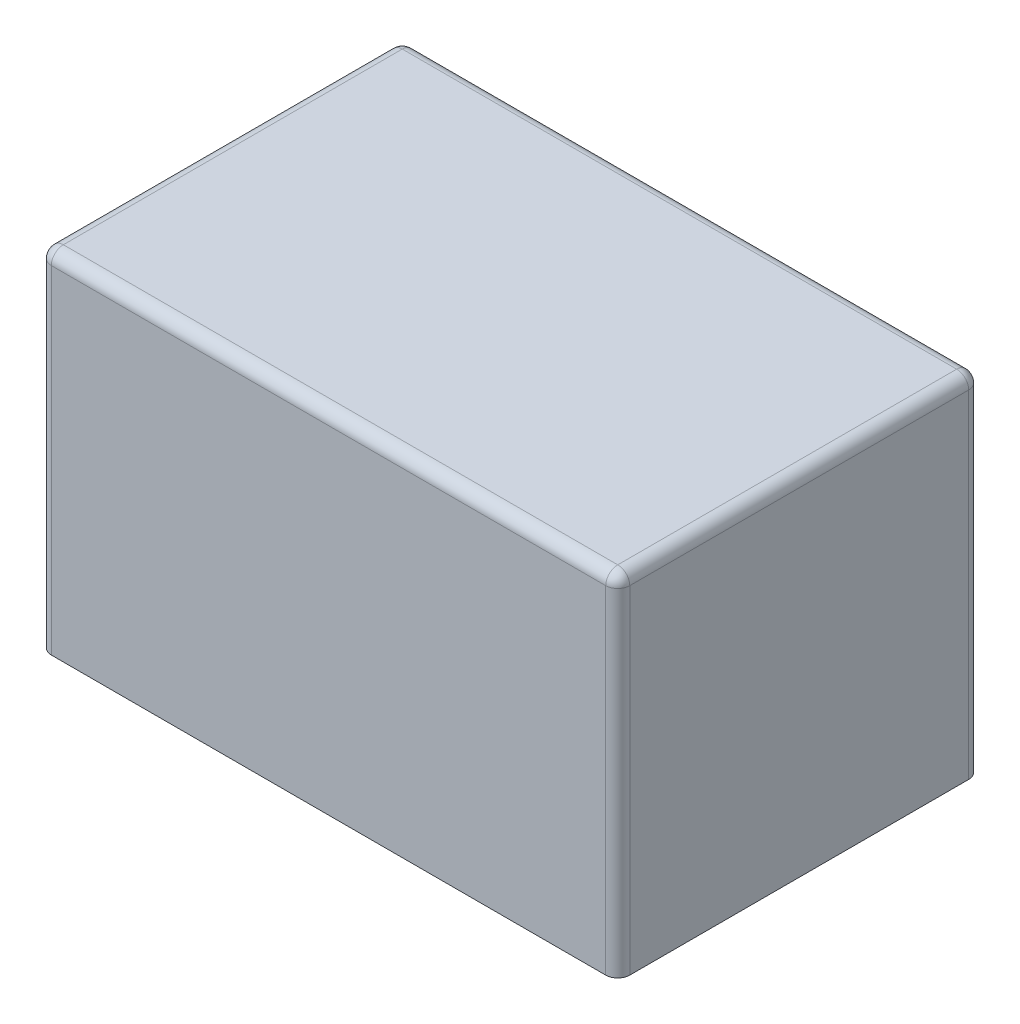
ISO-10303-21;
HEADER;
FILE_DESCRIPTION(('STEP AP214'),'2;1');
FILE_NAME('part.step','',(''),(''),'','','');
FILE_SCHEMA(('AUTOMOTIVE_DESIGN { 1 0 10303 214 1 1 1 1 }'));
ENDSEC;
DATA;
#1=APPLICATION_CONTEXT('core data for automotive mechanical design processes');
#2=APPLICATION_PROTOCOL_DEFINITION('international standard','automotive_design',2000,#1);
#3=PRODUCT_CONTEXT('',#1,'mechanical');
#4=PRODUCT('Part','Part','',(#3));
#5=PRODUCT_RELATED_PRODUCT_CATEGORY('part','',(#4));
#6=PRODUCT_DEFINITION_FORMATION('','',#4);
#7=PRODUCT_DEFINITION_CONTEXT('part definition',#1,'design');
#8=PRODUCT_DEFINITION('design','',#6,#7);
#9=PRODUCT_DEFINITION_SHAPE('','',#8);
#10=(LENGTH_UNIT() NAMED_UNIT(*) SI_UNIT(.MILLI.,.METRE.));
#11=(NAMED_UNIT(*) PLANE_ANGLE_UNIT() SI_UNIT($,.RADIAN.));
#12=(NAMED_UNIT(*) SI_UNIT($,.STERADIAN.) SOLID_ANGLE_UNIT());
#13=UNCERTAINTY_MEASURE_WITH_UNIT(LENGTH_MEASURE(1.E-05),#10,'distance_accuracy_value','');
#14=(GEOMETRIC_REPRESENTATION_CONTEXT(3) GLOBAL_UNCERTAINTY_ASSIGNED_CONTEXT((#13)) GLOBAL_UNIT_ASSIGNED_CONTEXT((#10,
#11,#12)) REPRESENTATION_CONTEXT('',''));
#15=CARTESIAN_POINT('',(0.,0.,0.));
#16=DIRECTION('',(0.,0.,1.));
#17=DIRECTION('',(1.,0.,0.));
#18=AXIS2_PLACEMENT_3D('',#15,#16,#17);
#19=CARTESIAN_POINT('',(-7.65,9.24,-4.8));
#20=DIRECTION('',(1.,0.,0.));
#21=DIRECTION('',(0.,0.,-1.));
#22=AXIS2_PLACEMENT_3D('',#19,#20,#21);
#23=PLANE('',#22);
#24=DIRECTION('',(0.,0.,1.));
#25=VECTOR('',#24,1.);
#26=CARTESIAN_POINT('',(-7.65,8.922,-4.8));
#27=LINE('',#26,#25);
#28=CARTESIAN_POINT('',(-7.65,8.922,4.482));
#29=VERTEX_POINT('',#28);
#30=CARTESIAN_POINT('',(-7.65,8.922,-4.482));
#31=VERTEX_POINT('',#30);
#32=EDGE_CURVE('E138',#29,#31,#27,.F.);
#33=ORIENTED_EDGE('',*,*,#32,.T.);
#34=DIRECTION('',(0.,-1.,0.));
#35=VECTOR('',#34,1.);
#36=CARTESIAN_POINT('',(-7.65,9.24,-4.482));
#37=LINE('',#36,#35);
#38=CARTESIAN_POINT('',(-7.65,0.,-4.482));
#39=VERTEX_POINT('',#38);
#40=EDGE_CURVE('E123',#31,#39,#37,.T.);
#41=ORIENTED_EDGE('',*,*,#40,.T.);
#42=DIRECTION('',(0.,0.,1.));
#43=VECTOR('',#42,1.);
#44=CARTESIAN_POINT('',(-7.65,0.,-4.8));
#45=LINE('',#44,#43);
#46=CARTESIAN_POINT('',(-7.65,0.,4.482));
#47=VERTEX_POINT('',#46);
#48=EDGE_CURVE('E135',#39,#47,#45,.T.);
#49=ORIENTED_EDGE('',*,*,#48,.T.);
#50=DIRECTION('',(0.,-1.,0.));
#51=VECTOR('',#50,1.);
#52=CARTESIAN_POINT('',(-7.65,9.24,4.482));
#53=LINE('',#52,#51);
#54=EDGE_CURVE('E163',#47,#29,#53,.F.);
#55=ORIENTED_EDGE('',*,*,#54,.T.);
#56=EDGE_LOOP('',(#33,#41,#49,#55));
#57=FACE_BOUND('',#56,.T.);
#58=ADVANCED_FACE('F39',(#57),#23,.F.);
#59=CARTESIAN_POINT('',(7.65,9.24,4.8));
#60=DIRECTION('',(0.,0.,-1.));
#61=DIRECTION('',(-1.,0.,0.));
#62=AXIS2_PLACEMENT_3D('',#59,#60,#61);
#63=PLANE('',#62);
#64=DIRECTION('',(1.,0.,0.));
#65=VECTOR('',#64,1.);
#66=CARTESIAN_POINT('',(7.65,0.,4.8));
#67=LINE('',#66,#65);
#68=CARTESIAN_POINT('',(-7.332,0.,4.8));
#69=VERTEX_POINT('',#68);
#70=CARTESIAN_POINT('',(7.332,0.,4.8));
#71=VERTEX_POINT('',#70);
#72=EDGE_CURVE('E147',#69,#71,#67,.T.);
#73=ORIENTED_EDGE('',*,*,#72,.T.);
#74=DIRECTION('',(0.,-1.,0.));
#75=VECTOR('',#74,1.);
#76=CARTESIAN_POINT('',(7.332,9.24,4.8));
#77=LINE('',#76,#75);
#78=CARTESIAN_POINT('',(7.332,8.922,4.8));
#79=VERTEX_POINT('',#78);
#80=EDGE_CURVE('E197',#71,#79,#77,.F.);
#81=ORIENTED_EDGE('',*,*,#80,.T.);
#82=DIRECTION('',(1.,0.,0.));
#83=VECTOR('',#82,1.);
#84=CARTESIAN_POINT('',(7.65,8.922,4.8));
#85=LINE('',#84,#83);
#86=CARTESIAN_POINT('',(-7.332,8.922,4.8));
#87=VERTEX_POINT('',#86);
#88=EDGE_CURVE('E194',#79,#87,#85,.F.);
#89=ORIENTED_EDGE('',*,*,#88,.T.);
#90=DIRECTION('',(0.,-1.,0.));
#91=VECTOR('',#90,1.);
#92=CARTESIAN_POINT('',(-7.332,9.24,4.8));
#93=LINE('',#92,#91);
#94=EDGE_CURVE('E191',#87,#69,#93,.T.);
#95=ORIENTED_EDGE('',*,*,#94,.T.);
#96=EDGE_LOOP('',(#73,#81,#89,#95));
#97=FACE_BOUND('',#96,.T.);
#98=ADVANCED_FACE('F290',(#97),#63,.F.);
#99=CARTESIAN_POINT('',(7.65,9.24,-4.8));
#100=DIRECTION('',(-1.,0.,0.));
#101=DIRECTION('',(0.,0.,1.));
#102=AXIS2_PLACEMENT_3D('',#99,#100,#101);
#103=PLANE('',#102);
#104=DIRECTION('',(0.,0.,-1.));
#105=VECTOR('',#104,1.);
#106=CARTESIAN_POINT('',(7.65,0.,-4.8));
#107=LINE('',#106,#105);
#108=CARTESIAN_POINT('',(7.65,0.,4.482));
#109=VERTEX_POINT('',#108);
#110=CARTESIAN_POINT('',(7.65,0.,-4.482));
#111=VERTEX_POINT('',#110);
#112=EDGE_CURVE('E152',#109,#111,#107,.T.);
#113=ORIENTED_EDGE('',*,*,#112,.T.);
#114=DIRECTION('',(0.,-1.,0.));
#115=VECTOR('',#114,1.);
#116=CARTESIAN_POINT('',(7.65,9.24,-4.482));
#117=LINE('',#116,#115);
#118=CARTESIAN_POINT('',(7.65,8.922,-4.482));
#119=VERTEX_POINT('',#118);
#120=EDGE_CURVE('E188',#111,#119,#117,.F.);
#121=ORIENTED_EDGE('',*,*,#120,.T.);
#122=DIRECTION('',(0.,0.,-1.));
#123=VECTOR('',#122,1.);
#124=CARTESIAN_POINT('',(7.65,8.922,-4.8));
#125=LINE('',#124,#123);
#126=CARTESIAN_POINT('',(7.65,8.922,4.482));
#127=VERTEX_POINT('',#126);
#128=EDGE_CURVE('E182',#119,#127,#125,.F.);
#129=ORIENTED_EDGE('',*,*,#128,.T.);
#130=DIRECTION('',(0.,-1.,0.));
#131=VECTOR('',#130,1.);
#132=CARTESIAN_POINT('',(7.65,9.24,4.482));
#133=LINE('',#132,#131);
#134=EDGE_CURVE('E185',#127,#109,#133,.T.);
#135=ORIENTED_EDGE('',*,*,#134,.T.);
#136=EDGE_LOOP('',(#113,#121,#129,#135));
#137=FACE_BOUND('',#136,.T.);
#138=ADVANCED_FACE('F263',(#137),#103,.F.);
#139=CARTESIAN_POINT('',(7.65,9.24,-4.8));
#140=DIRECTION('',(0.,0.,1.));
#141=DIRECTION('',(1.,0.,0.));
#142=AXIS2_PLACEMENT_3D('',#139,#140,#141);
#143=PLANE('',#142);
#144=DIRECTION('',(-1.,0.,0.));
#145=VECTOR('',#144,1.);
#146=CARTESIAN_POINT('',(7.65,0.,-4.8));
#147=LINE('',#146,#145);
#148=CARTESIAN_POINT('',(7.332,0.,-4.8));
#149=VERTEX_POINT('',#148);
#150=CARTESIAN_POINT('',(-7.332,0.,-4.8));
#151=VERTEX_POINT('',#150);
#152=EDGE_CURVE('E160',#149,#151,#147,.T.);
#153=ORIENTED_EDGE('',*,*,#152,.T.);
#154=DIRECTION('',(0.,-1.,0.));
#155=VECTOR('',#154,1.);
#156=CARTESIAN_POINT('',(-7.332,9.24,-4.8));
#157=LINE('',#156,#155);
#158=CARTESIAN_POINT('',(-7.332,8.922,-4.8));
#159=VERTEX_POINT('',#158);
#160=EDGE_CURVE('E124',#151,#159,#157,.F.);
#161=ORIENTED_EDGE('',*,*,#160,.T.);
#162=DIRECTION('',(-1.,0.,0.));
#163=VECTOR('',#162,1.);
#164=CARTESIAN_POINT('',(7.65,8.922,-4.8));
#165=LINE('',#164,#163);
#166=CARTESIAN_POINT('',(7.332,8.922,-4.8));
#167=VERTEX_POINT('',#166);
#168=EDGE_CURVE('E130',#159,#167,#165,.F.);
#169=ORIENTED_EDGE('',*,*,#168,.T.);
#170=DIRECTION('',(0.,-1.,0.));
#171=VECTOR('',#170,1.);
#172=CARTESIAN_POINT('',(7.332,9.24,-4.8));
#173=LINE('',#172,#171);
#174=EDGE_CURVE('E177',#167,#149,#173,.T.);
#175=ORIENTED_EDGE('',*,*,#174,.T.);
#176=EDGE_LOOP('',(#153,#161,#169,#175));
#177=FACE_BOUND('',#176,.T.);
#178=ADVANCED_FACE('F300',(#177),#143,.F.);
#179=CARTESIAN_POINT('',(0.,9.24,0.));
#180=DIRECTION('',(0.,-1.,0.));
#181=DIRECTION('',(0.,0.,-1.));
#182=AXIS2_PLACEMENT_3D('',#179,#180,#181);
#183=PLANE('',#182);
#184=DIRECTION('',(1.,0.,0.));
#185=VECTOR('',#184,1.);
#186=CARTESIAN_POINT('',(0.,9.24,4.482));
#187=LINE('',#186,#185);
#188=CARTESIAN_POINT('',(-7.332,9.24,4.482));
#189=VERTEX_POINT('',#188);
#190=CARTESIAN_POINT('',(7.332,9.24,4.482));
#191=VERTEX_POINT('',#190);
#192=EDGE_CURVE('E63',#189,#191,#187,.T.);
#193=ORIENTED_EDGE('',*,*,#192,.T.);
#194=DIRECTION('',(0.,0.,-1.));
#195=VECTOR('',#194,1.);
#196=CARTESIAN_POINT('',(7.332,9.24,0.));
#197=LINE('',#196,#195);
#198=CARTESIAN_POINT('',(7.332,9.24,-4.482));
#199=VERTEX_POINT('',#198);
#200=EDGE_CURVE('E11',#191,#199,#197,.T.);
#201=ORIENTED_EDGE('',*,*,#200,.T.);
#202=DIRECTION('',(-1.,0.,0.));
#203=VECTOR('',#202,1.);
#204=CARTESIAN_POINT('',(0.,9.24,-4.482));
#205=LINE('',#204,#203);
#206=CARTESIAN_POINT('',(-7.332,9.24,-4.482));
#207=VERTEX_POINT('',#206);
#208=EDGE_CURVE('E49',#199,#207,#205,.T.);
#209=ORIENTED_EDGE('',*,*,#208,.T.);
#210=DIRECTION('',(0.,0.,1.));
#211=VECTOR('',#210,1.);
#212=CARTESIAN_POINT('',(-7.332,9.24,0.));
#213=LINE('',#212,#211);
#214=EDGE_CURVE('E200',#207,#189,#213,.T.);
#215=ORIENTED_EDGE('',*,*,#214,.T.);
#216=EDGE_LOOP('',(#193,#201,#209,#215));
#217=FACE_BOUND('',#216,.T.);
#218=ADVANCED_FACE('F271',(#217),#183,.F.);
#219=CARTESIAN_POINT('',(0.,0.,0.));
#220=DIRECTION('',(0.,-1.,0.));
#221=DIRECTION('',(0.,0.,-1.));
#222=AXIS2_PLACEMENT_3D('',#219,#220,#221);
#223=PLANE('',#222);
#224=ORIENTED_EDGE('',*,*,#48,.F.);
#225=CARTESIAN_POINT('',(-7.332,0.,-4.482));
#226=DIRECTION('',(0.,-1.,0.));
#227=DIRECTION('',(0.,0.,-1.));
#228=AXIS2_PLACEMENT_3D('',#225,#226,#227);
#229=CIRCLE('',#228,0.318);
#230=EDGE_CURVE('E119',#39,#151,#229,.T.);
#231=ORIENTED_EDGE('',*,*,#230,.T.);
#232=ORIENTED_EDGE('',*,*,#152,.F.);
#233=CARTESIAN_POINT('',(7.332,0.,-4.482));
#234=DIRECTION('',(0.,-1.,0.));
#235=DIRECTION('',(0.,0.,-1.));
#236=AXIS2_PLACEMENT_3D('',#233,#234,#235);
#237=CIRCLE('',#236,0.318);
#238=EDGE_CURVE('E131',#149,#111,#237,.T.);
#239=ORIENTED_EDGE('',*,*,#238,.T.);
#240=ORIENTED_EDGE('',*,*,#112,.F.);
#241=CARTESIAN_POINT('',(7.332,0.,4.482));
#242=DIRECTION('',(0.,-1.,0.));
#243=DIRECTION('',(0.,0.,-1.));
#244=AXIS2_PLACEMENT_3D('',#241,#242,#243);
#245=CIRCLE('',#244,0.318);
#246=EDGE_CURVE('E170',#109,#71,#245,.T.);
#247=ORIENTED_EDGE('',*,*,#246,.T.);
#248=ORIENTED_EDGE('',*,*,#72,.F.);
#249=CARTESIAN_POINT('',(-7.332,0.,4.482));
#250=DIRECTION('',(0.,-1.,0.));
#251=DIRECTION('',(0.,0.,-1.));
#252=AXIS2_PLACEMENT_3D('',#249,#250,#251);
#253=CIRCLE('',#252,0.318);
#254=EDGE_CURVE('E141',#69,#47,#253,.T.);
#255=ORIENTED_EDGE('',*,*,#254,.T.);
#256=EDGE_LOOP('',(#224,#231,#232,#239,#240,#247,#248,#255));
#257=FACE_BOUND('',#256,.T.);
#258=ADVANCED_FACE('F143',(#257),#223,.T.);
#259=CARTESIAN_POINT('',(7.332,9.24,4.482));
#260=DIRECTION('',(0.,-1.,0.));
#261=DIRECTION('',(0.,0.,-1.));
#262=AXIS2_PLACEMENT_3D('',#259,#260,#261);
#263=CYLINDRICAL_SURFACE('',#262,0.318);
#264=CARTESIAN_POINT('',(7.332,8.922,4.482));
#265=DIRECTION('',(0.,1.,0.));
#266=DIRECTION('',(0.,0.,1.));
#267=AXIS2_PLACEMENT_3D('',#264,#265,#266);
#268=CIRCLE('',#267,0.318);
#269=EDGE_CURVE('E43',#79,#127,#268,.T.);
#270=ORIENTED_EDGE('',*,*,#269,.F.);
#271=ORIENTED_EDGE('',*,*,#80,.F.);
#272=ORIENTED_EDGE('',*,*,#246,.F.);
#273=ORIENTED_EDGE('',*,*,#134,.F.);
#274=EDGE_LOOP('',(#270,#271,#272,#273));
#275=FACE_BOUND('',#274,.T.);
#276=ADVANCED_FACE('F41',(#275),#263,.T.);
#277=CARTESIAN_POINT('',(7.332,8.922,4.482));
#278=DIRECTION('',(0.,0.,1.));
#279=DIRECTION('',(1.,0.,0.));
#280=AXIS2_PLACEMENT_3D('',#277,#278,#279);
#281=SPHERICAL_SURFACE('',#280,0.318);
#282=CARTESIAN_POINT('',(7.332,8.922,4.482));
#283=DIRECTION('',(1.,0.,0.));
#284=DIRECTION('',(0.,0.,-1.));
#285=AXIS2_PLACEMENT_3D('',#282,#283,#284);
#286=CIRCLE('',#285,0.318);
#287=EDGE_CURVE('E241',#79,#191,#286,.F.);
#288=ORIENTED_EDGE('',*,*,#287,.F.);
#289=ORIENTED_EDGE('',*,*,#269,.T.);
#290=CARTESIAN_POINT('',(7.332,8.922,4.482));
#291=DIRECTION('',(0.,0.,1.));
#292=DIRECTION('',(0.,-1.,0.));
#293=AXIS2_PLACEMENT_3D('',#290,#291,#292);
#294=CIRCLE('',#293,0.318);
#295=EDGE_CURVE('E155',#191,#127,#294,.F.);
#296=ORIENTED_EDGE('',*,*,#295,.F.);
#297=EDGE_LOOP('',(#288,#289,#296));
#298=FACE_BOUND('',#297,.T.);
#299=ADVANCED_FACE('F254',(#298),#281,.T.);
#300=CARTESIAN_POINT('',(7.332,9.24,-4.482));
#301=DIRECTION('',(0.,-1.,0.));
#302=DIRECTION('',(0.,0.,-1.));
#303=AXIS2_PLACEMENT_3D('',#300,#301,#302);
#304=CYLINDRICAL_SURFACE('',#303,0.318);
#305=ORIENTED_EDGE('',*,*,#238,.F.);
#306=ORIENTED_EDGE('',*,*,#174,.F.);
#307=CARTESIAN_POINT('',(7.332,8.922,-4.482));
#308=DIRECTION('',(0.,1.,0.));
#309=DIRECTION('',(0.,0.,1.));
#310=AXIS2_PLACEMENT_3D('',#307,#308,#309);
#311=CIRCLE('',#310,0.318);
#312=EDGE_CURVE('E237',#119,#167,#311,.T.);
#313=ORIENTED_EDGE('',*,*,#312,.F.);
#314=ORIENTED_EDGE('',*,*,#120,.F.);
#315=EDGE_LOOP('',(#305,#306,#313,#314));
#316=FACE_BOUND('',#315,.T.);
#317=ADVANCED_FACE('F268',(#316),#304,.T.);
#318=CARTESIAN_POINT('',(7.332,8.922,0.));
#319=DIRECTION('',(0.,0.,-1.));
#320=DIRECTION('',(-1.,0.,0.));
#321=AXIS2_PLACEMENT_3D('',#318,#319,#320);
#322=CYLINDRICAL_SURFACE('',#321,0.318);
#323=ORIENTED_EDGE('',*,*,#295,.T.);
#324=ORIENTED_EDGE('',*,*,#128,.F.);
#325=CARTESIAN_POINT('',(7.332,8.922,-4.482));
#326=DIRECTION('',(0.,0.,-1.));
#327=DIRECTION('',(-1.,0.,0.));
#328=AXIS2_PLACEMENT_3D('',#325,#326,#327);
#329=CIRCLE('',#328,0.318);
#330=EDGE_CURVE('E233',#199,#119,#329,.T.);
#331=ORIENTED_EDGE('',*,*,#330,.F.);
#332=ORIENTED_EDGE('',*,*,#200,.F.);
#333=EDGE_LOOP('',(#323,#324,#331,#332));
#334=FACE_BOUND('',#333,.T.);
#335=ADVANCED_FACE('F249',(#334),#322,.T.);
#336=CARTESIAN_POINT('',(0.,8.922,4.482));
#337=DIRECTION('',(1.,0.,0.));
#338=DIRECTION('',(0.,0.,-1.));
#339=AXIS2_PLACEMENT_3D('',#336,#337,#338);
#340=CYLINDRICAL_SURFACE('',#339,0.318);
#341=ORIENTED_EDGE('',*,*,#287,.T.);
#342=ORIENTED_EDGE('',*,*,#192,.F.);
#343=CARTESIAN_POINT('',(-7.332,8.922,4.482));
#344=DIRECTION('',(-1.,0.,0.));
#345=DIRECTION('',(0.,0.,1.));
#346=AXIS2_PLACEMENT_3D('',#343,#344,#345);
#347=CIRCLE('',#346,0.318);
#348=EDGE_CURVE('E229',#87,#189,#347,.T.);
#349=ORIENTED_EDGE('',*,*,#348,.F.);
#350=ORIENTED_EDGE('',*,*,#88,.F.);
#351=EDGE_LOOP('',(#341,#342,#349,#350));
#352=FACE_BOUND('',#351,.T.);
#353=ADVANCED_FACE('F337',(#352),#340,.T.);
#354=CARTESIAN_POINT('',(-7.332,9.24,4.482));
#355=DIRECTION('',(0.,-1.,0.));
#356=DIRECTION('',(0.,0.,-1.));
#357=AXIS2_PLACEMENT_3D('',#354,#355,#356);
#358=CYLINDRICAL_SURFACE('',#357,0.318);
#359=ORIENTED_EDGE('',*,*,#254,.F.);
#360=ORIENTED_EDGE('',*,*,#94,.F.);
#361=CARTESIAN_POINT('',(-7.332,8.922,4.482));
#362=DIRECTION('',(0.,1.,0.));
#363=DIRECTION('',(0.,0.,1.));
#364=AXIS2_PLACEMENT_3D('',#361,#362,#363);
#365=CIRCLE('',#364,0.318);
#366=EDGE_CURVE('E225',#29,#87,#365,.T.);
#367=ORIENTED_EDGE('',*,*,#366,.F.);
#368=ORIENTED_EDGE('',*,*,#54,.F.);
#369=EDGE_LOOP('',(#359,#360,#367,#368));
#370=FACE_BOUND('',#369,.T.);
#371=ADVANCED_FACE('F344',(#370),#358,.T.);
#372=CARTESIAN_POINT('',(7.332,8.922,-4.482));
#373=DIRECTION('',(0.,0.,1.));
#374=DIRECTION('',(1.,0.,0.));
#375=AXIS2_PLACEMENT_3D('',#372,#373,#374);
#376=SPHERICAL_SURFACE('',#375,0.318);
#377=ORIENTED_EDGE('',*,*,#330,.T.);
#378=ORIENTED_EDGE('',*,*,#312,.T.);
#379=CARTESIAN_POINT('',(7.332,8.922,-4.482));
#380=DIRECTION('',(1.,0.,0.));
#381=DIRECTION('',(0.,0.,-1.));
#382=AXIS2_PLACEMENT_3D('',#379,#380,#381);
#383=CIRCLE('',#382,0.318);
#384=EDGE_CURVE('E222',#199,#167,#383,.F.);
#385=ORIENTED_EDGE('',*,*,#384,.F.);
#386=EDGE_LOOP('',(#377,#378,#385));
#387=FACE_BOUND('',#386,.T.);
#388=ADVANCED_FACE('F270',(#387),#376,.T.);
#389=CARTESIAN_POINT('',(-7.332,8.922,4.482));
#390=DIRECTION('',(0.,0.,1.));
#391=DIRECTION('',(1.,0.,0.));
#392=AXIS2_PLACEMENT_3D('',#389,#390,#391);
#393=SPHERICAL_SURFACE('',#392,0.318);
#394=ORIENTED_EDGE('',*,*,#366,.T.);
#395=ORIENTED_EDGE('',*,*,#348,.T.);
#396=CARTESIAN_POINT('',(-7.332,8.922,4.482));
#397=DIRECTION('',(0.,0.,1.));
#398=DIRECTION('',(1.,0.,0.));
#399=AXIS2_PLACEMENT_3D('',#396,#397,#398);
#400=CIRCLE('',#399,0.318);
#401=EDGE_CURVE('E218',#29,#189,#400,.F.);
#402=ORIENTED_EDGE('',*,*,#401,.F.);
#403=EDGE_LOOP('',(#394,#395,#402));
#404=FACE_BOUND('',#403,.T.);
#405=ADVANCED_FACE('F359',(#404),#393,.T.);
#406=CARTESIAN_POINT('',(0.,8.922,-4.482));
#407=DIRECTION('',(-1.,0.,0.));
#408=DIRECTION('',(0.,0.,1.));
#409=AXIS2_PLACEMENT_3D('',#406,#407,#408);
#410=CYLINDRICAL_SURFACE('',#409,0.318);
#411=ORIENTED_EDGE('',*,*,#384,.T.);
#412=ORIENTED_EDGE('',*,*,#168,.F.);
#413=CARTESIAN_POINT('',(-7.332,8.922,-4.482));
#414=DIRECTION('',(-1.,0.,0.));
#415=DIRECTION('',(0.,0.,1.));
#416=AXIS2_PLACEMENT_3D('',#413,#414,#415);
#417=CIRCLE('',#416,0.318);
#418=EDGE_CURVE('E214',#207,#159,#417,.T.);
#419=ORIENTED_EDGE('',*,*,#418,.F.);
#420=ORIENTED_EDGE('',*,*,#208,.F.);
#421=EDGE_LOOP('',(#411,#412,#419,#420));
#422=FACE_BOUND('',#421,.T.);
#423=ADVANCED_FACE('F278',(#422),#410,.T.);
#424=CARTESIAN_POINT('',(-7.332,8.922,0.));
#425=DIRECTION('',(0.,0.,1.));
#426=DIRECTION('',(1.,0.,0.));
#427=AXIS2_PLACEMENT_3D('',#424,#425,#426);
#428=CYLINDRICAL_SURFACE('',#427,0.318);
#429=ORIENTED_EDGE('',*,*,#401,.T.);
#430=ORIENTED_EDGE('',*,*,#214,.F.);
#431=CARTESIAN_POINT('',(-7.332,8.922,-4.482));
#432=DIRECTION('',(0.,0.,-1.));
#433=DIRECTION('',(-1.,0.,0.));
#434=AXIS2_PLACEMENT_3D('',#431,#432,#433);
#435=CIRCLE('',#434,0.318);
#436=EDGE_CURVE('E210',#31,#207,#435,.T.);
#437=ORIENTED_EDGE('',*,*,#436,.F.);
#438=ORIENTED_EDGE('',*,*,#32,.F.);
#439=EDGE_LOOP('',(#429,#430,#437,#438));
#440=FACE_BOUND('',#439,.T.);
#441=ADVANCED_FACE('F274',(#440),#428,.T.);
#442=CARTESIAN_POINT('',(-7.332,8.922,-4.482));
#443=DIRECTION('',(0.,0.,1.));
#444=DIRECTION('',(1.,0.,0.));
#445=AXIS2_PLACEMENT_3D('',#442,#443,#444);
#446=SPHERICAL_SURFACE('',#445,0.318);
#447=ORIENTED_EDGE('',*,*,#436,.T.);
#448=ORIENTED_EDGE('',*,*,#418,.T.);
#449=CARTESIAN_POINT('',(-7.332,8.922,-4.482));
#450=DIRECTION('',(0.,1.,0.));
#451=DIRECTION('',(0.,0.,1.));
#452=AXIS2_PLACEMENT_3D('',#449,#450,#451);
#453=CIRCLE('',#452,0.318);
#454=EDGE_CURVE('E207',#31,#159,#453,.F.);
#455=ORIENTED_EDGE('',*,*,#454,.F.);
#456=EDGE_LOOP('',(#447,#448,#455));
#457=FACE_BOUND('',#456,.T.);
#458=ADVANCED_FACE('F280',(#457),#446,.T.);
#459=CARTESIAN_POINT('',(-7.332,9.24,-4.482));
#460=DIRECTION('',(0.,-1.,0.));
#461=DIRECTION('',(0.,0.,-1.));
#462=AXIS2_PLACEMENT_3D('',#459,#460,#461);
#463=CYLINDRICAL_SURFACE('',#462,0.318);
#464=ORIENTED_EDGE('',*,*,#454,.T.);
#465=ORIENTED_EDGE('',*,*,#160,.F.);
#466=ORIENTED_EDGE('',*,*,#230,.F.);
#467=ORIENTED_EDGE('',*,*,#40,.F.);
#468=EDGE_LOOP('',(#464,#465,#466,#467));
#469=FACE_BOUND('',#468,.T.);
#470=ADVANCED_FACE('F122',(#469),#463,.T.);
#471=CLOSED_SHELL('',(#58,#98,#138,#178,#218,#258,#276,#299,#317,#335,#353,#371,#388,#405,#423,
#441,#458,#470));
#472=MANIFOLD_SOLID_BREP('B2',#471);
#473=ADVANCED_BREP_SHAPE_REPRESENTATION('',(#18,#472),#14);
#474=SHAPE_DEFINITION_REPRESENTATION(#9,#473);
ENDSEC;
END-ISO-10303-21;
